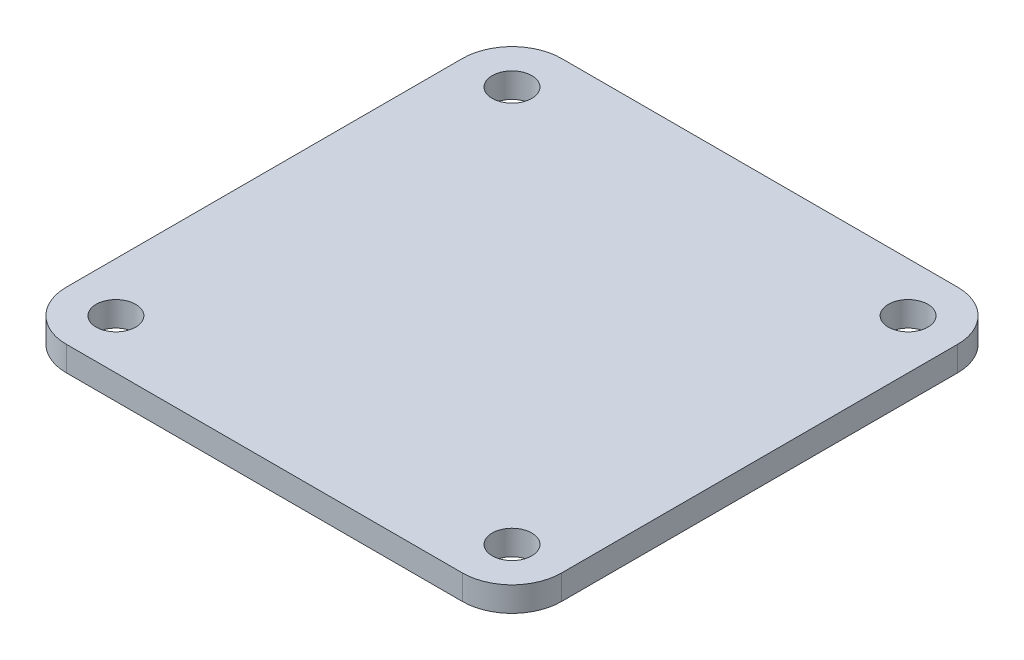
ISO-10303-21;
HEADER;
FILE_DESCRIPTION(('STEP AP214'),'2;1');
FILE_NAME('part.step','',(''),(''),'','','');
FILE_SCHEMA(('AUTOMOTIVE_DESIGN { 1 0 10303 214 1 1 1 1 }'));
ENDSEC;
DATA;
#1=APPLICATION_CONTEXT('core data for automotive mechanical design processes');
#2=APPLICATION_PROTOCOL_DEFINITION('international standard','automotive_design',2000,#1);
#3=PRODUCT_CONTEXT('',#1,'mechanical');
#4=PRODUCT('Part','Part','',(#3));
#5=PRODUCT_RELATED_PRODUCT_CATEGORY('part','',(#4));
#6=PRODUCT_DEFINITION_FORMATION('','',#4);
#7=PRODUCT_DEFINITION_CONTEXT('part definition',#1,'design');
#8=PRODUCT_DEFINITION('design','',#6,#7);
#9=PRODUCT_DEFINITION_SHAPE('','',#8);
#10=(LENGTH_UNIT() NAMED_UNIT(*) SI_UNIT(.MILLI.,.METRE.));
#11=(NAMED_UNIT(*) PLANE_ANGLE_UNIT() SI_UNIT($,.RADIAN.));
#12=(NAMED_UNIT(*) SI_UNIT($,.STERADIAN.) SOLID_ANGLE_UNIT());
#13=UNCERTAINTY_MEASURE_WITH_UNIT(LENGTH_MEASURE(1.E-05),#10,'distance_accuracy_value','');
#14=(GEOMETRIC_REPRESENTATION_CONTEXT(3) GLOBAL_UNCERTAINTY_ASSIGNED_CONTEXT((#13)) GLOBAL_UNIT_ASSIGNED_CONTEXT((#10,
#11,#12)) REPRESENTATION_CONTEXT('',''));
#15=CARTESIAN_POINT('',(0.,0.,0.));
#16=DIRECTION('',(0.,0.,1.));
#17=DIRECTION('',(1.,0.,0.));
#18=AXIS2_PLACEMENT_3D('',#15,#16,#17);
#19=CARTESIAN_POINT('',(-50.,5.,50.));
#20=DIRECTION('',(1.,0.,0.));
#21=DIRECTION('',(0.,0.,-1.));
#22=AXIS2_PLACEMENT_3D('',#19,#20,#21);
#23=PLANE('',#22);
#24=DIRECTION('',(0.,0.,1.));
#25=VECTOR('',#24,1.);
#26=CARTESIAN_POINT('',(-50.,0.,50.));
#27=LINE('',#26,#25);
#28=CARTESIAN_POINT('',(-50.,0.,-40.));
#29=VERTEX_POINT('',#28);
#30=CARTESIAN_POINT('',(-50.,0.,40.));
#31=VERTEX_POINT('',#30);
#32=EDGE_CURVE('E159',#29,#31,#27,.T.);
#33=ORIENTED_EDGE('',*,*,#32,.T.);
#34=DIRECTION('',(0.,-1.,0.));
#35=VECTOR('',#34,1.);
#36=CARTESIAN_POINT('',(-50.,5.,40.));
#37=LINE('',#36,#35);
#38=CARTESIAN_POINT('',(-50.,5.,40.));
#39=VERTEX_POINT('',#38);
#40=EDGE_CURVE('E11',#31,#39,#37,.F.);
#41=ORIENTED_EDGE('',*,*,#40,.T.);
#42=DIRECTION('',(0.,0.,1.));
#43=VECTOR('',#42,1.);
#44=CARTESIAN_POINT('',(-50.,5.,50.));
#45=LINE('',#44,#43);
#46=CARTESIAN_POINT('',(-50.,5.,-40.));
#47=VERTEX_POINT('',#46);
#48=EDGE_CURVE('E127',#47,#39,#45,.T.);
#49=ORIENTED_EDGE('',*,*,#48,.F.);
#50=DIRECTION('',(0.,-1.,0.));
#51=VECTOR('',#50,1.);
#52=CARTESIAN_POINT('',(-50.,5.,-40.));
#53=LINE('',#52,#51);
#54=EDGE_CURVE('E43',#47,#29,#53,.T.);
#55=ORIENTED_EDGE('',*,*,#54,.T.);
#56=EDGE_LOOP('',(#33,#41,#49,#55));
#57=FACE_BOUND('',#56,.T.);
#58=ADVANCED_FACE('F35',(#57),#23,.F.);
#59=CARTESIAN_POINT('',(50.,5.,50.));
#60=DIRECTION('',(0.,0.,-1.));
#61=DIRECTION('',(-1.,0.,0.));
#62=AXIS2_PLACEMENT_3D('',#59,#60,#61);
#63=PLANE('',#62);
#64=DIRECTION('',(1.,0.,0.));
#65=VECTOR('',#64,1.);
#66=CARTESIAN_POINT('',(50.,0.,50.));
#67=LINE('',#66,#65);
#68=CARTESIAN_POINT('',(-40.,0.,50.));
#69=VERTEX_POINT('',#68);
#70=CARTESIAN_POINT('',(40.,0.,50.));
#71=VERTEX_POINT('',#70);
#72=EDGE_CURVE('E132',#69,#71,#67,.T.);
#73=ORIENTED_EDGE('',*,*,#72,.T.);
#74=DIRECTION('',(0.,-1.,0.));
#75=VECTOR('',#74,1.);
#76=CARTESIAN_POINT('',(40.,5.,50.));
#77=LINE('',#76,#75);
#78=CARTESIAN_POINT('',(40.,5.,50.));
#79=VERTEX_POINT('',#78);
#80=EDGE_CURVE('E50',#71,#79,#77,.F.);
#81=ORIENTED_EDGE('',*,*,#80,.T.);
#82=DIRECTION('',(1.,0.,0.));
#83=VECTOR('',#82,1.);
#84=CARTESIAN_POINT('',(50.,5.,50.));
#85=LINE('',#84,#83);
#86=CARTESIAN_POINT('',(-40.,5.,50.));
#87=VERTEX_POINT('',#86);
#88=EDGE_CURVE('E130',#87,#79,#85,.T.);
#89=ORIENTED_EDGE('',*,*,#88,.F.);
#90=DIRECTION('',(0.,-1.,0.));
#91=VECTOR('',#90,1.);
#92=CARTESIAN_POINT('',(-40.,5.,50.));
#93=LINE('',#92,#91);
#94=EDGE_CURVE('E151',#87,#69,#93,.T.);
#95=ORIENTED_EDGE('',*,*,#94,.T.);
#96=EDGE_LOOP('',(#73,#81,#89,#95));
#97=FACE_BOUND('',#96,.T.);
#98=ADVANCED_FACE('F214',(#97),#63,.F.);
#99=CARTESIAN_POINT('',(50.,5.,50.));
#100=DIRECTION('',(-1.,0.,0.));
#101=DIRECTION('',(0.,0.,1.));
#102=AXIS2_PLACEMENT_3D('',#99,#100,#101);
#103=PLANE('',#102);
#104=DIRECTION('',(0.,0.,-1.));
#105=VECTOR('',#104,1.);
#106=CARTESIAN_POINT('',(50.,0.,50.));
#107=LINE('',#106,#105);
#108=CARTESIAN_POINT('',(50.,0.,40.));
#109=VERTEX_POINT('',#108);
#110=CARTESIAN_POINT('',(50.,0.,-40.));
#111=VERTEX_POINT('',#110);
#112=EDGE_CURVE('E128',#109,#111,#107,.T.);
#113=ORIENTED_EDGE('',*,*,#112,.T.);
#114=DIRECTION('',(0.,-1.,0.));
#115=VECTOR('',#114,1.);
#116=CARTESIAN_POINT('',(50.,5.,-40.));
#117=LINE('',#116,#115);
#118=CARTESIAN_POINT('',(50.,5.,-40.));
#119=VERTEX_POINT('',#118);
#120=EDGE_CURVE('E106',#111,#119,#117,.F.);
#121=ORIENTED_EDGE('',*,*,#120,.T.);
#122=DIRECTION('',(0.,0.,-1.));
#123=VECTOR('',#122,1.);
#124=CARTESIAN_POINT('',(50.,5.,50.));
#125=LINE('',#124,#123);
#126=CARTESIAN_POINT('',(50.,5.,40.));
#127=VERTEX_POINT('',#126);
#128=EDGE_CURVE('E171',#127,#119,#125,.T.);
#129=ORIENTED_EDGE('',*,*,#128,.F.);
#130=DIRECTION('',(0.,-1.,0.));
#131=VECTOR('',#130,1.);
#132=CARTESIAN_POINT('',(50.,5.,40.));
#133=LINE('',#132,#131);
#134=EDGE_CURVE('E111',#127,#109,#133,.T.);
#135=ORIENTED_EDGE('',*,*,#134,.T.);
#136=EDGE_LOOP('',(#113,#121,#129,#135));
#137=FACE_BOUND('',#136,.T.);
#138=ADVANCED_FACE('F211',(#137),#103,.F.);
#139=CARTESIAN_POINT('',(50.,5.,-50.));
#140=DIRECTION('',(0.,0.,1.));
#141=DIRECTION('',(1.,0.,0.));
#142=AXIS2_PLACEMENT_3D('',#139,#140,#141);
#143=PLANE('',#142);
#144=DIRECTION('',(-1.,0.,0.));
#145=VECTOR('',#144,1.);
#146=CARTESIAN_POINT('',(50.,5.,-50.));
#147=LINE('',#146,#145);
#148=CARTESIAN_POINT('',(40.,5.,-50.));
#149=VERTEX_POINT('',#148);
#150=CARTESIAN_POINT('',(-40.,5.,-50.));
#151=VERTEX_POINT('',#150);
#152=EDGE_CURVE('E121',#149,#151,#147,.T.);
#153=ORIENTED_EDGE('',*,*,#152,.F.);
#154=DIRECTION('',(0.,-1.,0.));
#155=VECTOR('',#154,1.);
#156=CARTESIAN_POINT('',(40.,5.,-50.));
#157=LINE('',#156,#155);
#158=CARTESIAN_POINT('',(40.,0.,-50.));
#159=VERTEX_POINT('',#158);
#160=EDGE_CURVE('E105',#149,#159,#157,.T.);
#161=ORIENTED_EDGE('',*,*,#160,.T.);
#162=DIRECTION('',(-1.,0.,0.));
#163=VECTOR('',#162,1.);
#164=CARTESIAN_POINT('',(50.,0.,-50.));
#165=LINE('',#164,#163);
#166=CARTESIAN_POINT('',(-40.,0.,-50.));
#167=VERTEX_POINT('',#166);
#168=EDGE_CURVE('E118',#159,#167,#165,.T.);
#169=ORIENTED_EDGE('',*,*,#168,.T.);
#170=DIRECTION('',(0.,-1.,0.));
#171=VECTOR('',#170,1.);
#172=CARTESIAN_POINT('',(-40.,5.,-50.));
#173=LINE('',#172,#171);
#174=EDGE_CURVE('E123',#167,#151,#173,.F.);
#175=ORIENTED_EDGE('',*,*,#174,.T.);
#176=EDGE_LOOP('',(#153,#161,#169,#175));
#177=FACE_BOUND('',#176,.T.);
#178=ADVANCED_FACE('F117',(#177),#143,.F.);
#179=CARTESIAN_POINT('',(0.,5.,0.));
#180=DIRECTION('',(0.,1.,0.));
#181=DIRECTION('',(0.,0.,1.));
#182=AXIS2_PLACEMENT_3D('',#179,#180,#181);
#183=PLANE('',#182);
#184=CARTESIAN_POINT('',(-40.,5.,40.));
#185=DIRECTION('',(0.,1.,0.));
#186=DIRECTION('',(0.,0.,1.));
#187=AXIS2_PLACEMENT_3D('',#184,#185,#186);
#188=CIRCLE('',#187,4.);
#189=CARTESIAN_POINT('',(-40.,5.,44.));
#190=VERTEX_POINT('',#189);
#191=EDGE_CURVE('E192',#190,#190,#188,.T.);
#192=ORIENTED_EDGE('',*,*,#191,.F.);
#193=EDGE_LOOP('',(#192));
#194=FACE_BOUND('',#193,.T.);
#195=CARTESIAN_POINT('',(-40.,5.,-40.));
#196=DIRECTION('',(0.,1.,0.));
#197=DIRECTION('',(0.,0.,1.));
#198=AXIS2_PLACEMENT_3D('',#195,#196,#197);
#199=CIRCLE('',#198,4.);
#200=CARTESIAN_POINT('',(-40.,5.,-36.));
#201=VERTEX_POINT('',#200);
#202=EDGE_CURVE('E186',#201,#201,#199,.T.);
#203=ORIENTED_EDGE('',*,*,#202,.F.);
#204=EDGE_LOOP('',(#203));
#205=FACE_BOUND('',#204,.T.);
#206=CARTESIAN_POINT('',(40.,5.,-40.));
#207=DIRECTION('',(0.,1.,0.));
#208=DIRECTION('',(0.,0.,1.));
#209=AXIS2_PLACEMENT_3D('',#206,#207,#208);
#210=CIRCLE('',#209,4.);
#211=CARTESIAN_POINT('',(40.,5.,-36.));
#212=VERTEX_POINT('',#211);
#213=EDGE_CURVE('E180',#212,#212,#210,.T.);
#214=ORIENTED_EDGE('',*,*,#213,.F.);
#215=EDGE_LOOP('',(#214));
#216=FACE_BOUND('',#215,.T.);
#217=CARTESIAN_POINT('',(40.,5.,40.));
#218=DIRECTION('',(0.,1.,0.));
#219=DIRECTION('',(0.,0.,1.));
#220=AXIS2_PLACEMENT_3D('',#217,#218,#219);
#221=CIRCLE('',#220,4.);
#222=CARTESIAN_POINT('',(40.,5.,44.));
#223=VERTEX_POINT('',#222);
#224=EDGE_CURVE('E167',#223,#223,#221,.T.);
#225=ORIENTED_EDGE('',*,*,#224,.F.);
#226=EDGE_LOOP('',(#225));
#227=FACE_BOUND('',#226,.T.);
#228=ORIENTED_EDGE('',*,*,#128,.T.);
#229=CARTESIAN_POINT('',(40.,5.,-40.));
#230=DIRECTION('',(0.,1.,0.));
#231=DIRECTION('',(0.,0.,1.));
#232=AXIS2_PLACEMENT_3D('',#229,#230,#231);
#233=CIRCLE('',#232,10.);
#234=EDGE_CURVE('E149',#119,#149,#233,.T.);
#235=ORIENTED_EDGE('',*,*,#234,.T.);
#236=ORIENTED_EDGE('',*,*,#152,.T.);
#237=CARTESIAN_POINT('',(-40.,5.,-40.));
#238=DIRECTION('',(0.,1.,0.));
#239=DIRECTION('',(0.,0.,1.));
#240=AXIS2_PLACEMENT_3D('',#237,#238,#239);
#241=CIRCLE('',#240,10.);
#242=EDGE_CURVE('E144',#151,#47,#241,.T.);
#243=ORIENTED_EDGE('',*,*,#242,.T.);
#244=ORIENTED_EDGE('',*,*,#48,.T.);
#245=CARTESIAN_POINT('',(-40.,5.,40.));
#246=DIRECTION('',(0.,1.,0.));
#247=DIRECTION('',(0.,0.,1.));
#248=AXIS2_PLACEMENT_3D('',#245,#246,#247);
#249=CIRCLE('',#248,10.);
#250=EDGE_CURVE('E57',#39,#87,#249,.T.);
#251=ORIENTED_EDGE('',*,*,#250,.T.);
#252=ORIENTED_EDGE('',*,*,#88,.T.);
#253=CARTESIAN_POINT('',(40.,5.,40.));
#254=DIRECTION('',(0.,1.,0.));
#255=DIRECTION('',(0.,0.,1.));
#256=AXIS2_PLACEMENT_3D('',#253,#254,#255);
#257=CIRCLE('',#256,10.);
#258=EDGE_CURVE('E147',#79,#127,#257,.T.);
#259=ORIENTED_EDGE('',*,*,#258,.T.);
#260=EDGE_LOOP('',(#228,#235,#236,#243,#244,#251,#252,#259));
#261=FACE_BOUND('',#260,.T.);
#262=ADVANCED_FACE('F198',(#194,#205,#216,#227,#261),#183,.T.);
#263=CARTESIAN_POINT('',(0.,0.,0.));
#264=DIRECTION('',(0.,1.,0.));
#265=DIRECTION('',(0.,0.,1.));
#266=AXIS2_PLACEMENT_3D('',#263,#264,#265);
#267=PLANE('',#266);
#268=CARTESIAN_POINT('',(-40.,0.,40.));
#269=DIRECTION('',(0.,1.,0.));
#270=DIRECTION('',(0.,0.,1.));
#271=AXIS2_PLACEMENT_3D('',#268,#269,#270);
#272=CIRCLE('',#271,4.);
#273=CARTESIAN_POINT('',(-40.,0.,44.));
#274=VERTEX_POINT('',#273);
#275=EDGE_CURVE('E189',#274,#274,#272,.T.);
#276=ORIENTED_EDGE('',*,*,#275,.T.);
#277=EDGE_LOOP('',(#276));
#278=FACE_BOUND('',#277,.T.);
#279=CARTESIAN_POINT('',(-40.,0.,-40.));
#280=DIRECTION('',(0.,1.,0.));
#281=DIRECTION('',(0.,0.,1.));
#282=AXIS2_PLACEMENT_3D('',#279,#280,#281);
#283=CIRCLE('',#282,4.);
#284=CARTESIAN_POINT('',(-40.,0.,-36.));
#285=VERTEX_POINT('',#284);
#286=EDGE_CURVE('E183',#285,#285,#283,.T.);
#287=ORIENTED_EDGE('',*,*,#286,.T.);
#288=EDGE_LOOP('',(#287));
#289=FACE_BOUND('',#288,.T.);
#290=CARTESIAN_POINT('',(40.,0.,-40.));
#291=DIRECTION('',(0.,1.,0.));
#292=DIRECTION('',(0.,0.,1.));
#293=AXIS2_PLACEMENT_3D('',#290,#291,#292);
#294=CIRCLE('',#293,4.);
#295=CARTESIAN_POINT('',(40.,0.,-36.));
#296=VERTEX_POINT('',#295);
#297=EDGE_CURVE('E177',#296,#296,#294,.T.);
#298=ORIENTED_EDGE('',*,*,#297,.T.);
#299=EDGE_LOOP('',(#298));
#300=FACE_BOUND('',#299,.T.);
#301=CARTESIAN_POINT('',(40.,0.,40.));
#302=DIRECTION('',(0.,1.,0.));
#303=DIRECTION('',(0.,0.,1.));
#304=AXIS2_PLACEMENT_3D('',#301,#302,#303);
#305=CIRCLE('',#304,4.);
#306=CARTESIAN_POINT('',(40.,0.,44.));
#307=VERTEX_POINT('',#306);
#308=EDGE_CURVE('E164',#307,#307,#305,.T.);
#309=ORIENTED_EDGE('',*,*,#308,.T.);
#310=EDGE_LOOP('',(#309));
#311=FACE_BOUND('',#310,.T.);
#312=ORIENTED_EDGE('',*,*,#168,.F.);
#313=CARTESIAN_POINT('',(40.,0.,-40.));
#314=DIRECTION('',(0.,1.,0.));
#315=DIRECTION('',(0.,0.,1.));
#316=AXIS2_PLACEMENT_3D('',#313,#314,#315);
#317=CIRCLE('',#316,10.);
#318=EDGE_CURVE('E101',#159,#111,#317,.F.);
#319=ORIENTED_EDGE('',*,*,#318,.T.);
#320=ORIENTED_EDGE('',*,*,#112,.F.);
#321=CARTESIAN_POINT('',(40.,0.,40.));
#322=DIRECTION('',(0.,1.,0.));
#323=DIRECTION('',(0.,0.,1.));
#324=AXIS2_PLACEMENT_3D('',#321,#322,#323);
#325=CIRCLE('',#324,10.);
#326=EDGE_CURVE('E112',#109,#71,#325,.F.);
#327=ORIENTED_EDGE('',*,*,#326,.T.);
#328=ORIENTED_EDGE('',*,*,#72,.F.);
#329=CARTESIAN_POINT('',(-40.,0.,40.));
#330=DIRECTION('',(0.,1.,0.));
#331=DIRECTION('',(0.,0.,1.));
#332=AXIS2_PLACEMENT_3D('',#329,#330,#331);
#333=CIRCLE('',#332,10.);
#334=EDGE_CURVE('E138',#69,#31,#333,.F.);
#335=ORIENTED_EDGE('',*,*,#334,.T.);
#336=ORIENTED_EDGE('',*,*,#32,.F.);
#337=CARTESIAN_POINT('',(-40.,0.,-40.));
#338=DIRECTION('',(0.,1.,0.));
#339=DIRECTION('',(0.,0.,1.));
#340=AXIS2_PLACEMENT_3D('',#337,#338,#339);
#341=CIRCLE('',#340,10.);
#342=EDGE_CURVE('E122',#29,#167,#341,.F.);
#343=ORIENTED_EDGE('',*,*,#342,.T.);
#344=EDGE_LOOP('',(#312,#319,#320,#327,#328,#335,#336,#343));
#345=FACE_BOUND('',#344,.T.);
#346=ADVANCED_FACE('F125',(#278,#289,#300,#311,#345),#267,.F.);
#347=CARTESIAN_POINT('',(40.,5.,40.));
#348=DIRECTION('',(0.,1.,0.));
#349=DIRECTION('',(0.,0.,1.));
#350=AXIS2_PLACEMENT_3D('',#347,#348,#349);
#351=CYLINDRICAL_SURFACE('',#350,4.);
#352=ORIENTED_EDGE('',*,*,#308,.F.);
#353=EDGE_LOOP('',(#352));
#354=FACE_BOUND('',#353,.T.);
#355=ORIENTED_EDGE('',*,*,#224,.T.);
#356=EDGE_LOOP('',(#355));
#357=FACE_BOUND('',#356,.T.);
#358=ADVANCED_FACE('F280',(#354,#357),#351,.F.);
#359=CARTESIAN_POINT('',(40.,5.,-40.));
#360=DIRECTION('',(0.,1.,0.));
#361=DIRECTION('',(0.,0.,1.));
#362=AXIS2_PLACEMENT_3D('',#359,#360,#361);
#363=CYLINDRICAL_SURFACE('',#362,4.);
#364=ORIENTED_EDGE('',*,*,#297,.F.);
#365=EDGE_LOOP('',(#364));
#366=FACE_BOUND('',#365,.T.);
#367=ORIENTED_EDGE('',*,*,#213,.T.);
#368=EDGE_LOOP('',(#367));
#369=FACE_BOUND('',#368,.T.);
#370=ADVANCED_FACE('F271',(#366,#369),#363,.F.);
#371=CARTESIAN_POINT('',(-40.,5.,-40.));
#372=DIRECTION('',(0.,1.,0.));
#373=DIRECTION('',(0.,0.,1.));
#374=AXIS2_PLACEMENT_3D('',#371,#372,#373);
#375=CYLINDRICAL_SURFACE('',#374,4.);
#376=ORIENTED_EDGE('',*,*,#286,.F.);
#377=EDGE_LOOP('',(#376));
#378=FACE_BOUND('',#377,.T.);
#379=ORIENTED_EDGE('',*,*,#202,.T.);
#380=EDGE_LOOP('',(#379));
#381=FACE_BOUND('',#380,.T.);
#382=ADVANCED_FACE('F262',(#378,#381),#375,.F.);
#383=CARTESIAN_POINT('',(-40.,5.,40.));
#384=DIRECTION('',(0.,1.,0.));
#385=DIRECTION('',(0.,0.,1.));
#386=AXIS2_PLACEMENT_3D('',#383,#384,#385);
#387=CYLINDRICAL_SURFACE('',#386,4.);
#388=ORIENTED_EDGE('',*,*,#275,.F.);
#389=EDGE_LOOP('',(#388));
#390=FACE_BOUND('',#389,.T.);
#391=ORIENTED_EDGE('',*,*,#191,.T.);
#392=EDGE_LOOP('',(#391));
#393=FACE_BOUND('',#392,.T.);
#394=ADVANCED_FACE('F196',(#390,#393),#387,.F.);
#395=CARTESIAN_POINT('',(40.,5.,-40.));
#396=DIRECTION('',(0.,-1.,0.));
#397=DIRECTION('',(0.,0.,-1.));
#398=AXIS2_PLACEMENT_3D('',#395,#396,#397);
#399=CYLINDRICAL_SURFACE('',#398,10.);
#400=ORIENTED_EDGE('',*,*,#234,.F.);
#401=ORIENTED_EDGE('',*,*,#120,.F.);
#402=ORIENTED_EDGE('',*,*,#318,.F.);
#403=ORIENTED_EDGE('',*,*,#160,.F.);
#404=EDGE_LOOP('',(#400,#401,#402,#403));
#405=FACE_BOUND('',#404,.T.);
#406=ADVANCED_FACE('F104',(#405),#399,.T.);
#407=CARTESIAN_POINT('',(40.,5.,40.));
#408=DIRECTION('',(0.,-1.,0.));
#409=DIRECTION('',(0.,0.,-1.));
#410=AXIS2_PLACEMENT_3D('',#407,#408,#409);
#411=CYLINDRICAL_SURFACE('',#410,10.);
#412=ORIENTED_EDGE('',*,*,#258,.F.);
#413=ORIENTED_EDGE('',*,*,#80,.F.);
#414=ORIENTED_EDGE('',*,*,#326,.F.);
#415=ORIENTED_EDGE('',*,*,#134,.F.);
#416=EDGE_LOOP('',(#412,#413,#414,#415));
#417=FACE_BOUND('',#416,.T.);
#418=ADVANCED_FACE('F213',(#417),#411,.T.);
#419=CARTESIAN_POINT('',(-40.,5.,40.));
#420=DIRECTION('',(0.,-1.,0.));
#421=DIRECTION('',(0.,0.,-1.));
#422=AXIS2_PLACEMENT_3D('',#419,#420,#421);
#423=CYLINDRICAL_SURFACE('',#422,10.);
#424=ORIENTED_EDGE('',*,*,#250,.F.);
#425=ORIENTED_EDGE('',*,*,#40,.F.);
#426=ORIENTED_EDGE('',*,*,#334,.F.);
#427=ORIENTED_EDGE('',*,*,#94,.F.);
#428=EDGE_LOOP('',(#424,#425,#426,#427));
#429=FACE_BOUND('',#428,.T.);
#430=ADVANCED_FACE('F217',(#429),#423,.T.);
#431=CARTESIAN_POINT('',(-40.,5.,-40.));
#432=DIRECTION('',(0.,-1.,0.));
#433=DIRECTION('',(0.,0.,-1.));
#434=AXIS2_PLACEMENT_3D('',#431,#432,#433);
#435=CYLINDRICAL_SURFACE('',#434,10.);
#436=ORIENTED_EDGE('',*,*,#242,.F.);
#437=ORIENTED_EDGE('',*,*,#174,.F.);
#438=ORIENTED_EDGE('',*,*,#342,.F.);
#439=ORIENTED_EDGE('',*,*,#54,.F.);
#440=EDGE_LOOP('',(#436,#437,#438,#439));
#441=FACE_BOUND('',#440,.T.);
#442=ADVANCED_FACE('F37',(#441),#435,.T.);
#443=CLOSED_SHELL('',(#58,#98,#138,#178,#262,#346,#358,#370,#382,#394,#406,#418,#430,#442));
#444=MANIFOLD_SOLID_BREP('B2',#443);
#445=ADVANCED_BREP_SHAPE_REPRESENTATION('',(#18,#444),#14);
#446=SHAPE_DEFINITION_REPRESENTATION(#9,#445);
ENDSEC;
END-ISO-10303-21;
